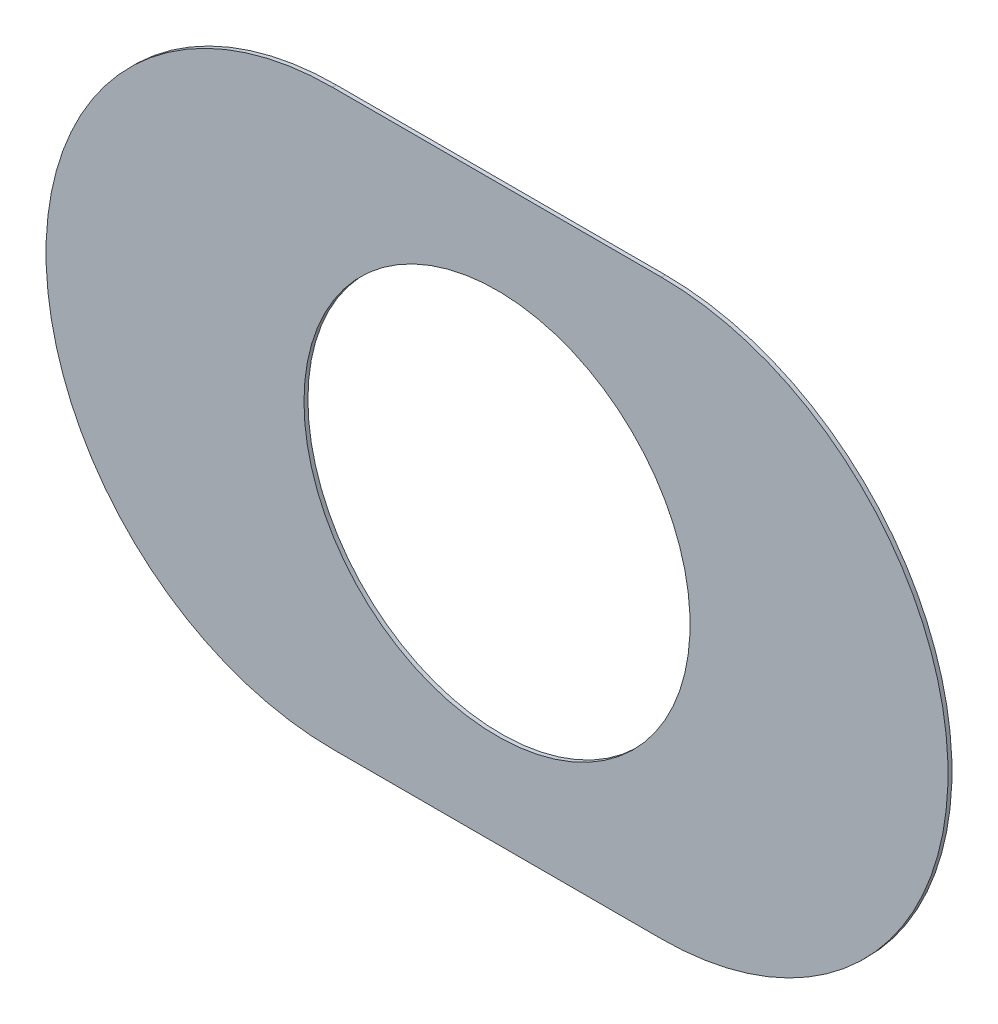
ISO-10303-21;
HEADER;
FILE_DESCRIPTION(('STEP AP214'),'2;1');
FILE_NAME('part.step','',(''),(''),'','','');
FILE_SCHEMA(('AUTOMOTIVE_DESIGN { 1 0 10303 214 1 1 1 1 }'));
ENDSEC;
DATA;
#1=APPLICATION_CONTEXT('core data for automotive mechanical design processes');
#2=APPLICATION_PROTOCOL_DEFINITION('international standard','automotive_design',2000,#1);
#3=PRODUCT_CONTEXT('',#1,'mechanical');
#4=PRODUCT('Part','Part','',(#3));
#5=PRODUCT_RELATED_PRODUCT_CATEGORY('part','',(#4));
#6=PRODUCT_DEFINITION_FORMATION('','',#4);
#7=PRODUCT_DEFINITION_CONTEXT('part definition',#1,'design');
#8=PRODUCT_DEFINITION('design','',#6,#7);
#9=PRODUCT_DEFINITION_SHAPE('','',#8);
#10=(LENGTH_UNIT() NAMED_UNIT(*) SI_UNIT(.MILLI.,.METRE.));
#11=(NAMED_UNIT(*) PLANE_ANGLE_UNIT() SI_UNIT($,.RADIAN.));
#12=(NAMED_UNIT(*) SI_UNIT($,.STERADIAN.) SOLID_ANGLE_UNIT());
#13=UNCERTAINTY_MEASURE_WITH_UNIT(LENGTH_MEASURE(1.E-05),#10,'distance_accuracy_value','');
#14=(GEOMETRIC_REPRESENTATION_CONTEXT(3) GLOBAL_UNCERTAINTY_ASSIGNED_CONTEXT((#13)) GLOBAL_UNIT_ASSIGNED_CONTEXT((#10,
#11,#12)) REPRESENTATION_CONTEXT('',''));
#15=CARTESIAN_POINT('',(0.,0.,0.));
#16=DIRECTION('',(0.,0.,1.));
#17=DIRECTION('',(1.,0.,0.));
#18=AXIS2_PLACEMENT_3D('',#15,#16,#17);
#19=CARTESIAN_POINT('',(1.54999965727325,17.0800006854535,0.));
#20=DIRECTION('',(0.,0.,-1.));
#21=DIRECTION('',(0.,-1.,0.));
#22=AXIS2_PLACEMENT_3D('',#19,#20,#21);
#23=PLANE('',#22);
#24=CARTESIAN_POINT('',(1.54999965727325,17.0800006854535,0.));
#25=DIRECTION('',(0.,0.,1.));
#26=DIRECTION('',(1.,0.,0.));
#27=AXIS2_PLACEMENT_3D('',#24,#25,#26);
#28=CIRCLE('',#27,0.49);
#29=CARTESIAN_POINT('',(1.05999965727325,17.0800006854535,0.));
#30=VERTEX_POINT('',#29);
#31=EDGE_CURVE('E98',#30,#30,#28,.T.);
#32=ORIENTED_EDGE('',*,*,#31,.F.);
#33=EDGE_LOOP('',(#32));
#34=FACE_BOUND('',#33,.T.);
#35=CARTESIAN_POINT('',(1.96740611181985,17.0800006854535,0.));
#36=DIRECTION('',(0.,0.,-1.));
#37=DIRECTION('',(0.,1.,0.));
#38=AXIS2_PLACEMENT_3D('',#35,#36,#37);
#39=CIRCLE('',#38,0.727257121659981);
#40=CARTESIAN_POINT('',(1.96740611181985,17.8072578071135,0.));
#41=VERTEX_POINT('',#40);
#42=CARTESIAN_POINT('',(1.96740611181985,16.3527435637935,0.));
#43=VERTEX_POINT('',#42);
#44=EDGE_CURVE('E28',#41,#43,#39,.T.);
#45=ORIENTED_EDGE('',*,*,#44,.F.);
#46=DIRECTION('',(1.,0.,0.));
#47=VECTOR('',#46,1.);
#48=CARTESIAN_POINT('',(1.13259320272665,17.8072578071135,0.));
#49=LINE('',#48,#47);
#50=CARTESIAN_POINT('',(1.13259320272665,17.8072578071135,0.));
#51=VERTEX_POINT('',#50);
#52=EDGE_CURVE('E91',#51,#41,#49,.T.);
#53=ORIENTED_EDGE('',*,*,#52,.F.);
#54=CARTESIAN_POINT('',(1.13259320272665,17.0800006854535,0.));
#55=DIRECTION('',(0.,0.,-1.));
#56=DIRECTION('',(0.,-1.,0.));
#57=AXIS2_PLACEMENT_3D('',#54,#55,#56);
#58=CIRCLE('',#57,0.727257121659981);
#59=CARTESIAN_POINT('',(1.13259320272665,16.3527435637935,0.));
#60=VERTEX_POINT('',#59);
#61=EDGE_CURVE('E75',#60,#51,#58,.T.);
#62=ORIENTED_EDGE('',*,*,#61,.F.);
#63=DIRECTION('',(-1.,0.,0.));
#64=VECTOR('',#63,1.);
#65=CARTESIAN_POINT('',(1.96740611181985,16.3527435637935,0.));
#66=LINE('',#65,#64);
#67=EDGE_CURVE('E109',#43,#60,#66,.T.);
#68=ORIENTED_EDGE('',*,*,#67,.F.);
#69=EDGE_LOOP('',(#45,#53,#62,#68));
#70=FACE_BOUND('',#69,.T.);
#71=ADVANCED_FACE('F17',(#34,#70),#23,.F.);
#72=CARTESIAN_POINT('',(1.54999965727325,17.0800006854535,-0.01));
#73=DIRECTION('',(0.,0.,-1.));
#74=DIRECTION('',(0.,-1.,0.));
#75=AXIS2_PLACEMENT_3D('',#72,#73,#74);
#76=PLANE('',#75);
#77=CARTESIAN_POINT('',(1.54999965727325,17.0800006854535,-0.01));
#78=DIRECTION('',(0.,0.,1.));
#79=DIRECTION('',(1.,0.,0.));
#80=AXIS2_PLACEMENT_3D('',#77,#78,#79);
#81=CIRCLE('',#80,0.49);
#82=CARTESIAN_POINT('',(1.05999965727325,17.0800006854535,-0.01));
#83=VERTEX_POINT('',#82);
#84=EDGE_CURVE('E115',#83,#83,#81,.T.);
#85=ORIENTED_EDGE('',*,*,#84,.T.);
#86=EDGE_LOOP('',(#85));
#87=FACE_BOUND('',#86,.T.);
#88=CARTESIAN_POINT('',(1.96740611181985,17.0800006854535,-0.01));
#89=DIRECTION('',(0.,0.,-1.));
#90=DIRECTION('',(0.,1.,0.));
#91=AXIS2_PLACEMENT_3D('',#88,#89,#90);
#92=CIRCLE('',#91,0.727257121659981);
#93=CARTESIAN_POINT('',(1.96740611181985,17.8072578071135,-0.01));
#94=VERTEX_POINT('',#93);
#95=CARTESIAN_POINT('',(1.96740611181985,16.3527435637935,-0.01));
#96=VERTEX_POINT('',#95);
#97=EDGE_CURVE('E11',#94,#96,#92,.T.);
#98=ORIENTED_EDGE('',*,*,#97,.T.);
#99=DIRECTION('',(-1.,0.,0.));
#100=VECTOR('',#99,1.);
#101=CARTESIAN_POINT('',(1.96740611181985,16.3527435637935,-0.01));
#102=LINE('',#101,#100);
#103=CARTESIAN_POINT('',(1.13259320272665,16.3527435637935,-0.01));
#104=VERTEX_POINT('',#103);
#105=EDGE_CURVE('E119',#96,#104,#102,.T.);
#106=ORIENTED_EDGE('',*,*,#105,.T.);
#107=CARTESIAN_POINT('',(1.13259320272665,17.0800006854535,-0.01));
#108=DIRECTION('',(0.,0.,-1.));
#109=DIRECTION('',(0.,-1.,0.));
#110=AXIS2_PLACEMENT_3D('',#107,#108,#109);
#111=CIRCLE('',#110,0.727257121659981);
#112=CARTESIAN_POINT('',(1.13259320272665,17.8072578071135,-0.01));
#113=VERTEX_POINT('',#112);
#114=EDGE_CURVE('E86',#104,#113,#111,.T.);
#115=ORIENTED_EDGE('',*,*,#114,.T.);
#116=DIRECTION('',(1.,0.,0.));
#117=VECTOR('',#116,1.);
#118=CARTESIAN_POINT('',(1.13259320272665,17.8072578071135,-0.01));
#119=LINE('',#118,#117);
#120=EDGE_CURVE('E92',#113,#94,#119,.T.);
#121=ORIENTED_EDGE('',*,*,#120,.T.);
#122=EDGE_LOOP('',(#98,#106,#115,#121));
#123=FACE_BOUND('',#122,.T.);
#124=ADVANCED_FACE('F131',(#87,#123),#76,.T.);
#125=CARTESIAN_POINT('',(1.96740611181985,17.0800006854535,0.));
#126=DIRECTION('',(0.,0.,-1.));
#127=DIRECTION('',(0.,1.,0.));
#128=AXIS2_PLACEMENT_3D('',#125,#126,#127);
#129=CYLINDRICAL_SURFACE('',#128,0.727257121659981);
#130=ORIENTED_EDGE('',*,*,#44,.T.);
#131=DIRECTION('',(0.,0.,-1.));
#132=VECTOR('',#131,1.);
#133=CARTESIAN_POINT('',(1.96740611181985,16.3527435637935,0.));
#134=LINE('',#133,#132);
#135=EDGE_CURVE('E114',#43,#96,#134,.T.);
#136=ORIENTED_EDGE('',*,*,#135,.T.);
#137=ORIENTED_EDGE('',*,*,#97,.F.);
#138=DIRECTION('',(0.,0.,-1.));
#139=VECTOR('',#138,1.);
#140=CARTESIAN_POINT('',(1.96740611181985,17.8072578071135,0.));
#141=LINE('',#140,#139);
#142=EDGE_CURVE('E97',#41,#94,#141,.T.);
#143=ORIENTED_EDGE('',*,*,#142,.F.);
#144=EDGE_LOOP('',(#130,#136,#137,#143));
#145=FACE_BOUND('',#144,.T.);
#146=ADVANCED_FACE('F127',(#145),#129,.T.);
#147=CARTESIAN_POINT('',(1.96740611181985,16.3527435637935,0.));
#148=DIRECTION('',(0.,-1.,0.));
#149=DIRECTION('',(0.,0.,-1.));
#150=AXIS2_PLACEMENT_3D('',#147,#148,#149);
#151=PLANE('',#150);
#152=ORIENTED_EDGE('',*,*,#67,.T.);
#153=DIRECTION('',(0.,0.,-1.));
#154=VECTOR('',#153,1.);
#155=CARTESIAN_POINT('',(1.13259320272665,16.3527435637935,0.));
#156=LINE('',#155,#154);
#157=EDGE_CURVE('E21',#60,#104,#156,.T.);
#158=ORIENTED_EDGE('',*,*,#157,.T.);
#159=ORIENTED_EDGE('',*,*,#105,.F.);
#160=ORIENTED_EDGE('',*,*,#135,.F.);
#161=EDGE_LOOP('',(#152,#158,#159,#160));
#162=FACE_BOUND('',#161,.T.);
#163=ADVANCED_FACE('F130',(#162),#151,.T.);
#164=CARTESIAN_POINT('',(1.13259320272665,17.0800006854535,0.));
#165=DIRECTION('',(0.,0.,-1.));
#166=DIRECTION('',(0.,-1.,0.));
#167=AXIS2_PLACEMENT_3D('',#164,#165,#166);
#168=CYLINDRICAL_SURFACE('',#167,0.727257121659981);
#169=ORIENTED_EDGE('',*,*,#61,.T.);
#170=DIRECTION('',(0.,0.,-1.));
#171=VECTOR('',#170,1.);
#172=CARTESIAN_POINT('',(1.13259320272665,17.8072578071135,0.));
#173=LINE('',#172,#171);
#174=EDGE_CURVE('E79',#51,#113,#173,.T.);
#175=ORIENTED_EDGE('',*,*,#174,.T.);
#176=ORIENTED_EDGE('',*,*,#114,.F.);
#177=ORIENTED_EDGE('',*,*,#157,.F.);
#178=EDGE_LOOP('',(#169,#175,#176,#177));
#179=FACE_BOUND('',#178,.T.);
#180=ADVANCED_FACE('F77',(#179),#168,.T.);
#181=CARTESIAN_POINT('',(1.13259320272665,17.8072578071135,0.));
#182=DIRECTION('',(0.,1.,0.));
#183=DIRECTION('',(1.,0.,0.));
#184=AXIS2_PLACEMENT_3D('',#181,#182,#183);
#185=PLANE('',#184);
#186=ORIENTED_EDGE('',*,*,#52,.T.);
#187=ORIENTED_EDGE('',*,*,#142,.T.);
#188=ORIENTED_EDGE('',*,*,#120,.F.);
#189=ORIENTED_EDGE('',*,*,#174,.F.);
#190=EDGE_LOOP('',(#186,#187,#188,#189));
#191=FACE_BOUND('',#190,.T.);
#192=ADVANCED_FACE('F19',(#191),#185,.T.);
#193=CARTESIAN_POINT('',(1.54999965727325,17.0800006854535,0.));
#194=DIRECTION('',(0.,0.,-1.));
#195=DIRECTION('',(1.,0.,0.));
#196=AXIS2_PLACEMENT_3D('',#193,#194,#195);
#197=CYLINDRICAL_SURFACE('',#196,0.49);
#198=ORIENTED_EDGE('',*,*,#84,.F.);
#199=DIRECTION('',(0.,0.,1.));
#200=VECTOR('',#199,1.);
#201=CARTESIAN_POINT('',(1.05999965727325,17.0800006854535,0.));
#202=LINE('',#201,#200);
#203=EDGE_CURVE('E105',#83,#30,#202,.T.);
#204=ORIENTED_EDGE('',*,*,#203,.T.);
#205=ORIENTED_EDGE('',*,*,#31,.T.);
#206=ORIENTED_EDGE('',*,*,#203,.F.);
#207=EDGE_LOOP('',(#198,#204,#205,#206));
#208=FACE_BOUND('',#207,.T.);
#209=ADVANCED_FACE('F141',(#208),#197,.F.);
#210=CLOSED_SHELL('',(#71,#124,#146,#163,#180,#192,#209));
#211=MANIFOLD_SOLID_BREP('B1',#210);
#212=ADVANCED_BREP_SHAPE_REPRESENTATION('',(#18,#211),#14);
#213=SHAPE_DEFINITION_REPRESENTATION(#9,#212);
ENDSEC;
END-ISO-10303-21;
